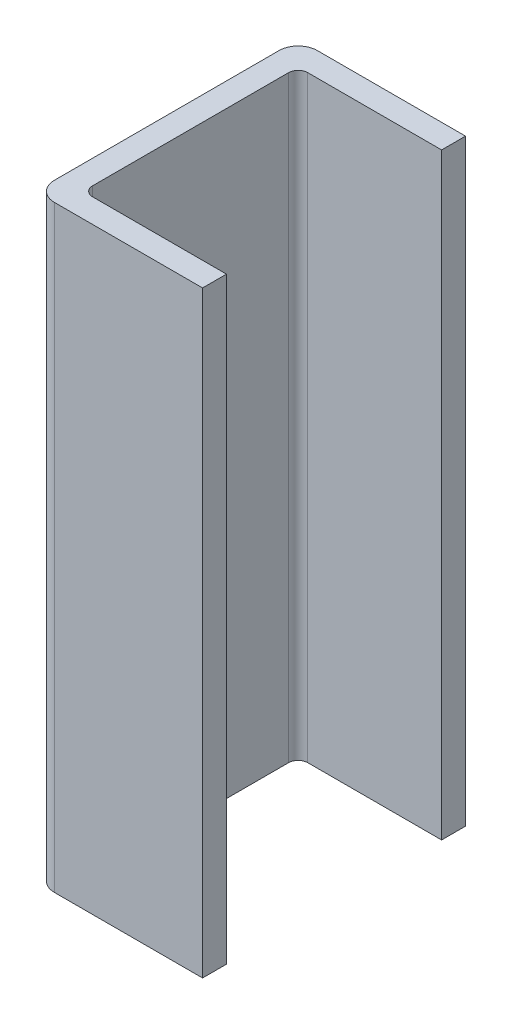
ISO-10303-21;
HEADER;
FILE_DESCRIPTION(('STEP AP214'),'2;1');
FILE_NAME('part.step','',(''),(''),'','','');
FILE_SCHEMA(('AUTOMOTIVE_DESIGN { 1 0 10303 214 1 1 1 1 }'));
ENDSEC;
DATA;
#1=APPLICATION_CONTEXT('core data for automotive mechanical design processes');
#2=APPLICATION_PROTOCOL_DEFINITION('international standard','automotive_design',2000,#1);
#3=PRODUCT_CONTEXT('',#1,'mechanical');
#4=PRODUCT('Part','Part','',(#3));
#5=PRODUCT_RELATED_PRODUCT_CATEGORY('part','',(#4));
#6=PRODUCT_DEFINITION_FORMATION('','',#4);
#7=PRODUCT_DEFINITION_CONTEXT('part definition',#1,'design');
#8=PRODUCT_DEFINITION('design','',#6,#7);
#9=PRODUCT_DEFINITION_SHAPE('','',#8);
#10=(LENGTH_UNIT() NAMED_UNIT(*) SI_UNIT(.MILLI.,.METRE.));
#11=(NAMED_UNIT(*) PLANE_ANGLE_UNIT() SI_UNIT($,.RADIAN.));
#12=(NAMED_UNIT(*) SI_UNIT($,.STERADIAN.) SOLID_ANGLE_UNIT());
#13=UNCERTAINTY_MEASURE_WITH_UNIT(LENGTH_MEASURE(1.E-05),#10,'distance_accuracy_value','');
#14=(GEOMETRIC_REPRESENTATION_CONTEXT(3) GLOBAL_UNCERTAINTY_ASSIGNED_CONTEXT((#13)) GLOBAL_UNIT_ASSIGNED_CONTEXT((#10,
#11,#12)) REPRESENTATION_CONTEXT('',''));
#15=CARTESIAN_POINT('',(0.,0.,0.));
#16=DIRECTION('',(0.,0.,1.));
#17=DIRECTION('',(1.,0.,0.));
#18=AXIS2_PLACEMENT_3D('',#15,#16,#17);
#19=CARTESIAN_POINT('',(-0.93,-0.625,0.07));
#20=DIRECTION('',(0.,-1.,0.));
#21=DIRECTION('',(-0.707106781186548,0.,-0.707106781186547));
#22=AXIS2_PLACEMENT_3D('',#19,#20,#21);
#23=CYLINDRICAL_SURFACE('',#22,0.02);
#24=CARTESIAN_POINT('',(-0.93,0.625,0.07));
#25=DIRECTION('',(0.,1.,0.));
#26=DIRECTION('',(0.,0.,-1.));
#27=AXIS2_PLACEMENT_3D('',#24,#25,#26);
#28=CIRCLE('',#27,0.02);
#29=CARTESIAN_POINT('',(-0.93,0.625,0.05));
#30=VERTEX_POINT('',#29);
#31=CARTESIAN_POINT('',(-0.95,0.625,0.07));
#32=VERTEX_POINT('',#31);
#33=EDGE_CURVE('E11',#30,#32,#28,.T.);
#34=ORIENTED_EDGE('',*,*,#33,.T.);
#35=DIRECTION('',(0.,-1.,0.));
#36=VECTOR('',#35,1.);
#37=CARTESIAN_POINT('',(-0.95,0.625,0.07));
#38=LINE('',#37,#36);
#39=CARTESIAN_POINT('',(-0.95,-0.625,0.07));
#40=VERTEX_POINT('',#39);
#41=EDGE_CURVE('E24',#32,#40,#38,.T.);
#42=ORIENTED_EDGE('',*,*,#41,.T.);
#43=CARTESIAN_POINT('',(-0.93,-0.625,0.07));
#44=DIRECTION('',(0.,-1.,0.));
#45=DIRECTION('',(-1.,0.,0.));
#46=AXIS2_PLACEMENT_3D('',#43,#44,#45);
#47=CIRCLE('',#46,0.02);
#48=CARTESIAN_POINT('',(-0.93,-0.625,0.05));
#49=VERTEX_POINT('',#48);
#50=EDGE_CURVE('E193',#40,#49,#47,.T.);
#51=ORIENTED_EDGE('',*,*,#50,.T.);
#52=DIRECTION('',(0.,1.,0.));
#53=VECTOR('',#52,1.);
#54=CARTESIAN_POINT('',(-0.93,-0.625,0.05));
#55=LINE('',#54,#53);
#56=EDGE_CURVE('E186',#49,#30,#55,.T.);
#57=ORIENTED_EDGE('',*,*,#56,.T.);
#58=EDGE_LOOP('',(#34,#42,#51,#57));
#59=FACE_BOUND('',#58,.T.);
#60=ADVANCED_FACE('F17',(#59),#23,.F.);
#61=CARTESIAN_POINT('',(-0.95,-0.625,0.55));
#62=DIRECTION('',(1.,0.,0.));
#63=DIRECTION('',(0.,0.,-1.));
#64=AXIS2_PLACEMENT_3D('',#61,#62,#63);
#65=PLANE('',#64);
#66=ORIENTED_EDGE('',*,*,#41,.F.);
#67=DIRECTION('',(0.,0.,1.));
#68=VECTOR('',#67,1.);
#69=CARTESIAN_POINT('',(-0.95,0.625,0.07));
#70=LINE('',#69,#68);
#71=CARTESIAN_POINT('',(-0.95,0.625,0.48));
#72=VERTEX_POINT('',#71);
#73=EDGE_CURVE('E195',#32,#72,#70,.T.);
#74=ORIENTED_EDGE('',*,*,#73,.T.);
#75=DIRECTION('',(0.,1.,0.));
#76=VECTOR('',#75,1.);
#77=CARTESIAN_POINT('',(-0.95,-0.625,0.48));
#78=LINE('',#77,#76);
#79=CARTESIAN_POINT('',(-0.95,-0.625,0.48));
#80=VERTEX_POINT('',#79);
#81=EDGE_CURVE('E188',#80,#72,#78,.T.);
#82=ORIENTED_EDGE('',*,*,#81,.F.);
#83=DIRECTION('',(0.,0.,-1.));
#84=VECTOR('',#83,1.);
#85=CARTESIAN_POINT('',(-0.95,-0.625,0.48));
#86=LINE('',#85,#84);
#87=EDGE_CURVE('E180',#80,#40,#86,.T.);
#88=ORIENTED_EDGE('',*,*,#87,.T.);
#89=EDGE_LOOP('',(#66,#74,#82,#88));
#90=FACE_BOUND('',#89,.T.);
#91=ADVANCED_FACE('F202',(#90),#65,.T.);
#92=CARTESIAN_POINT('',(-0.93,-0.625,0.48));
#93=DIRECTION('',(0.,1.,0.));
#94=DIRECTION('',(-0.707106781186548,0.,0.707106781186548));
#95=AXIS2_PLACEMENT_3D('',#92,#93,#94);
#96=CYLINDRICAL_SURFACE('',#95,0.02);
#97=CARTESIAN_POINT('',(-0.93,-0.625,0.48));
#98=DIRECTION('',(0.,-1.,0.));
#99=DIRECTION('',(0.,0.,1.));
#100=AXIS2_PLACEMENT_3D('',#97,#98,#99);
#101=CIRCLE('',#100,0.02);
#102=CARTESIAN_POINT('',(-0.93,-0.625,0.5));
#103=VERTEX_POINT('',#102);
#104=EDGE_CURVE('E107',#103,#80,#101,.T.);
#105=ORIENTED_EDGE('',*,*,#104,.T.);
#106=ORIENTED_EDGE('',*,*,#81,.T.);
#107=CARTESIAN_POINT('',(-0.93,0.625,0.48));
#108=DIRECTION('',(0.,1.,0.));
#109=DIRECTION('',(-1.,0.,0.));
#110=AXIS2_PLACEMENT_3D('',#107,#108,#109);
#111=CIRCLE('',#110,0.02);
#112=CARTESIAN_POINT('',(-0.93,0.625,0.5));
#113=VERTEX_POINT('',#112);
#114=EDGE_CURVE('E182',#72,#113,#111,.T.);
#115=ORIENTED_EDGE('',*,*,#114,.T.);
#116=DIRECTION('',(0.,-1.,0.));
#117=VECTOR('',#116,1.);
#118=CARTESIAN_POINT('',(-0.93,0.625,0.5));
#119=LINE('',#118,#117);
#120=EDGE_CURVE('E174',#113,#103,#119,.T.);
#121=ORIENTED_EDGE('',*,*,#120,.T.);
#122=EDGE_LOOP('',(#105,#106,#115,#121));
#123=FACE_BOUND('',#122,.T.);
#124=ADVANCED_FACE('F199',(#123),#96,.F.);
#125=CARTESIAN_POINT('',(-0.96,0.3125,0.04));
#126=DIRECTION('',(0.,-1.,0.));
#127=DIRECTION('',(-0.707106781186548,0.,-0.707106781186547));
#128=AXIS2_PLACEMENT_3D('',#125,#126,#127);
#129=CYLINDRICAL_SURFACE('',#128,0.04);
#130=CARTESIAN_POINT('',(-0.96,-0.625,0.04));
#131=DIRECTION('',(0.,1.,0.));
#132=DIRECTION('',(0.,0.,-1.));
#133=AXIS2_PLACEMENT_3D('',#130,#131,#132);
#134=CIRCLE('',#133,0.04);
#135=CARTESIAN_POINT('',(-0.96,-0.625,0.));
#136=VERTEX_POINT('',#135);
#137=CARTESIAN_POINT('',(-1.,-0.625,0.04));
#138=VERTEX_POINT('',#137);
#139=EDGE_CURVE('E191',#136,#138,#134,.T.);
#140=ORIENTED_EDGE('',*,*,#139,.T.);
#141=DIRECTION('',(0.,1.,0.));
#142=VECTOR('',#141,1.);
#143=CARTESIAN_POINT('',(-1.,-0.625,0.04));
#144=LINE('',#143,#142);
#145=CARTESIAN_POINT('',(-1.,0.625,0.04));
#146=VERTEX_POINT('',#145);
#147=EDGE_CURVE('E184',#138,#146,#144,.T.);
#148=ORIENTED_EDGE('',*,*,#147,.T.);
#149=CARTESIAN_POINT('',(-0.96,0.625,0.04));
#150=DIRECTION('',(0.,-1.,0.));
#151=DIRECTION('',(-1.,0.,0.));
#152=AXIS2_PLACEMENT_3D('',#149,#150,#151);
#153=CIRCLE('',#152,0.04);
#154=CARTESIAN_POINT('',(-0.96,0.625,0.));
#155=VERTEX_POINT('',#154);
#156=EDGE_CURVE('E176',#146,#155,#153,.T.);
#157=ORIENTED_EDGE('',*,*,#156,.T.);
#158=DIRECTION('',(0.,-1.,0.));
#159=VECTOR('',#158,1.);
#160=CARTESIAN_POINT('',(-0.96,0.625,0.));
#161=LINE('',#160,#159);
#162=EDGE_CURVE('E164',#155,#136,#161,.T.);
#163=ORIENTED_EDGE('',*,*,#162,.T.);
#164=EDGE_LOOP('',(#140,#148,#157,#163));
#165=FACE_BOUND('',#164,.T.);
#166=ADVANCED_FACE('F228',(#165),#129,.T.);
#167=CARTESIAN_POINT('',(-1.,0.625,0.));
#168=DIRECTION('',(-1.,0.,0.));
#169=DIRECTION('',(0.,-1.,0.));
#170=AXIS2_PLACEMENT_3D('',#167,#168,#169);
#171=PLANE('',#170);
#172=ORIENTED_EDGE('',*,*,#147,.F.);
#173=DIRECTION('',(0.,0.,1.));
#174=VECTOR('',#173,1.);
#175=CARTESIAN_POINT('',(-1.,-0.625,0.04));
#176=LINE('',#175,#174);
#177=CARTESIAN_POINT('',(-1.,-0.625,0.51));
#178=VERTEX_POINT('',#177);
#179=EDGE_CURVE('E178',#138,#178,#176,.T.);
#180=ORIENTED_EDGE('',*,*,#179,.T.);
#181=DIRECTION('',(0.,-1.,0.));
#182=VECTOR('',#181,1.);
#183=CARTESIAN_POINT('',(-1.,0.625,0.51));
#184=LINE('',#183,#182);
#185=CARTESIAN_POINT('',(-1.,0.625,0.51));
#186=VERTEX_POINT('',#185);
#187=EDGE_CURVE('E167',#186,#178,#184,.T.);
#188=ORIENTED_EDGE('',*,*,#187,.F.);
#189=DIRECTION('',(0.,0.,1.));
#190=VECTOR('',#189,1.);
#191=CARTESIAN_POINT('',(-1.,0.625,0.04));
#192=LINE('',#191,#190);
#193=EDGE_CURVE('E156',#146,#186,#192,.T.);
#194=ORIENTED_EDGE('',*,*,#193,.F.);
#195=EDGE_LOOP('',(#172,#180,#188,#194));
#196=FACE_BOUND('',#195,.T.);
#197=ADVANCED_FACE('F226',(#196),#171,.T.);
#198=CARTESIAN_POINT('',(-1.,-0.625,0.));
#199=DIRECTION('',(0.,-1.,0.));
#200=DIRECTION('',(1.,0.,0.));
#201=AXIS2_PLACEMENT_3D('',#198,#199,#200);
#202=PLANE('',#201);
#203=ORIENTED_EDGE('',*,*,#139,.F.);
#204=DIRECTION('',(1.,0.,0.));
#205=VECTOR('',#204,1.);
#206=CARTESIAN_POINT('',(-0.96,-0.625,0.));
#207=LINE('',#206,#205);
#208=CARTESIAN_POINT('',(-0.65,-0.625,0.));
#209=VERTEX_POINT('',#208);
#210=EDGE_CURVE('E170',#136,#209,#207,.T.);
#211=ORIENTED_EDGE('',*,*,#210,.T.);
#212=DIRECTION('',(0.,0.,-1.));
#213=VECTOR('',#212,1.);
#214=CARTESIAN_POINT('',(-0.65,-0.625,0.05));
#215=LINE('',#214,#213);
#216=CARTESIAN_POINT('',(-0.65,-0.625,0.05));
#217=VERTEX_POINT('',#216);
#218=EDGE_CURVE('E159',#217,#209,#215,.T.);
#219=ORIENTED_EDGE('',*,*,#218,.F.);
#220=DIRECTION('',(1.,0.,0.));
#221=VECTOR('',#220,1.);
#222=CARTESIAN_POINT('',(-0.93,-0.625,0.05));
#223=LINE('',#222,#221);
#224=EDGE_CURVE('E147',#49,#217,#223,.T.);
#225=ORIENTED_EDGE('',*,*,#224,.F.);
#226=ORIENTED_EDGE('',*,*,#50,.F.);
#227=ORIENTED_EDGE('',*,*,#87,.F.);
#228=ORIENTED_EDGE('',*,*,#104,.F.);
#229=DIRECTION('',(-1.,0.,0.));
#230=VECTOR('',#229,1.);
#231=CARTESIAN_POINT('',(-0.65,-0.625,0.5));
#232=LINE('',#231,#230);
#233=CARTESIAN_POINT('',(-0.65,-0.625,0.5));
#234=VERTEX_POINT('',#233);
#235=EDGE_CURVE('E101',#234,#103,#232,.T.);
#236=ORIENTED_EDGE('',*,*,#235,.F.);
#237=DIRECTION('',(0.,0.,-1.));
#238=VECTOR('',#237,1.);
#239=CARTESIAN_POINT('',(-0.65,-0.625,0.55));
#240=LINE('',#239,#238);
#241=CARTESIAN_POINT('',(-0.65,-0.625,0.55));
#242=VERTEX_POINT('',#241);
#243=EDGE_CURVE('E105',#242,#234,#240,.T.);
#244=ORIENTED_EDGE('',*,*,#243,.F.);
#245=DIRECTION('',(1.,0.,0.));
#246=VECTOR('',#245,1.);
#247=CARTESIAN_POINT('',(-0.96,-0.625,0.55));
#248=LINE('',#247,#246);
#249=CARTESIAN_POINT('',(-0.96,-0.625,0.55));
#250=VERTEX_POINT('',#249);
#251=EDGE_CURVE('E111',#250,#242,#248,.T.);
#252=ORIENTED_EDGE('',*,*,#251,.F.);
#253=CARTESIAN_POINT('',(-0.96,-0.625,0.51));
#254=DIRECTION('',(0.,1.,0.));
#255=DIRECTION('',(-1.,0.,0.));
#256=AXIS2_PLACEMENT_3D('',#253,#254,#255);
#257=CIRCLE('',#256,0.04);
#258=EDGE_CURVE('E172',#178,#250,#257,.T.);
#259=ORIENTED_EDGE('',*,*,#258,.F.);
#260=ORIENTED_EDGE('',*,*,#179,.F.);
#261=EDGE_LOOP('',(#203,#211,#219,#225,#226,#227,#228,#236,#244,#252,#259,#260));
#262=FACE_BOUND('',#261,.T.);
#263=ADVANCED_FACE('F103',(#262),#202,.T.);
#264=CARTESIAN_POINT('',(-0.96,0.,0.51));
#265=DIRECTION('',(0.,-1.,0.));
#266=DIRECTION('',(-0.707106781186548,0.,0.707106781186548));
#267=AXIS2_PLACEMENT_3D('',#264,#265,#266);
#268=CYLINDRICAL_SURFACE('',#267,0.04);
#269=ORIENTED_EDGE('',*,*,#258,.T.);
#270=DIRECTION('',(0.,1.,0.));
#271=VECTOR('',#270,1.);
#272=CARTESIAN_POINT('',(-0.96,-0.625,0.55));
#273=LINE('',#272,#271);
#274=CARTESIAN_POINT('',(-0.96,0.625,0.55));
#275=VERTEX_POINT('',#274);
#276=EDGE_CURVE('E162',#250,#275,#273,.T.);
#277=ORIENTED_EDGE('',*,*,#276,.T.);
#278=CARTESIAN_POINT('',(-0.96,0.625,0.51));
#279=DIRECTION('',(0.,-1.,0.));
#280=DIRECTION('',(0.,0.,1.));
#281=AXIS2_PLACEMENT_3D('',#278,#279,#280);
#282=CIRCLE('',#281,0.04);
#283=EDGE_CURVE('E150',#275,#186,#282,.T.);
#284=ORIENTED_EDGE('',*,*,#283,.T.);
#285=ORIENTED_EDGE('',*,*,#187,.T.);
#286=EDGE_LOOP('',(#269,#277,#284,#285));
#287=FACE_BOUND('',#286,.T.);
#288=ADVANCED_FACE('F222',(#287),#268,.T.);
#289=CARTESIAN_POINT('',(0.,0.,0.));
#290=DIRECTION('',(0.,0.,1.));
#291=DIRECTION('',(1.,0.,0.));
#292=AXIS2_PLACEMENT_3D('',#289,#290,#291);
#293=PLANE('',#292);
#294=ORIENTED_EDGE('',*,*,#162,.F.);
#295=DIRECTION('',(-1.,0.,0.));
#296=VECTOR('',#295,1.);
#297=CARTESIAN_POINT('',(-0.65,0.625,0.));
#298=LINE('',#297,#296);
#299=CARTESIAN_POINT('',(-0.65,0.625,0.));
#300=VERTEX_POINT('',#299);
#301=EDGE_CURVE('E153',#300,#155,#298,.T.);
#302=ORIENTED_EDGE('',*,*,#301,.F.);
#303=DIRECTION('',(0.,1.,0.));
#304=VECTOR('',#303,1.);
#305=CARTESIAN_POINT('',(-0.65,-0.625,0.));
#306=LINE('',#305,#304);
#307=EDGE_CURVE('E142',#209,#300,#306,.T.);
#308=ORIENTED_EDGE('',*,*,#307,.F.);
#309=ORIENTED_EDGE('',*,*,#210,.F.);
#310=EDGE_LOOP('',(#294,#302,#308,#309));
#311=FACE_BOUND('',#310,.T.);
#312=ADVANCED_FACE('F233',(#311),#293,.F.);
#313=CARTESIAN_POINT('',(1.,0.625,0.));
#314=DIRECTION('',(0.,1.,0.));
#315=DIRECTION('',(-1.,0.,0.));
#316=AXIS2_PLACEMENT_3D('',#313,#314,#315);
#317=PLANE('',#316);
#318=ORIENTED_EDGE('',*,*,#156,.F.);
#319=ORIENTED_EDGE('',*,*,#193,.T.);
#320=ORIENTED_EDGE('',*,*,#283,.F.);
#321=DIRECTION('',(-1.,0.,0.));
#322=VECTOR('',#321,1.);
#323=CARTESIAN_POINT('',(-0.65,0.625,0.55));
#324=LINE('',#323,#322);
#325=CARTESIAN_POINT('',(-0.65,0.625,0.55));
#326=VERTEX_POINT('',#325);
#327=EDGE_CURVE('E136',#326,#275,#324,.T.);
#328=ORIENTED_EDGE('',*,*,#327,.F.);
#329=DIRECTION('',(0.,0.,1.));
#330=VECTOR('',#329,1.);
#331=CARTESIAN_POINT('',(-0.65,0.625,0.5));
#332=LINE('',#331,#330);
#333=CARTESIAN_POINT('',(-0.65,0.625,0.5));
#334=VERTEX_POINT('',#333);
#335=EDGE_CURVE('E134',#334,#326,#332,.T.);
#336=ORIENTED_EDGE('',*,*,#335,.F.);
#337=DIRECTION('',(1.,0.,0.));
#338=VECTOR('',#337,1.);
#339=CARTESIAN_POINT('',(-0.93,0.625,0.5));
#340=LINE('',#339,#338);
#341=EDGE_CURVE('E121',#113,#334,#340,.T.);
#342=ORIENTED_EDGE('',*,*,#341,.F.);
#343=ORIENTED_EDGE('',*,*,#114,.F.);
#344=ORIENTED_EDGE('',*,*,#73,.F.);
#345=ORIENTED_EDGE('',*,*,#33,.F.);
#346=DIRECTION('',(-1.,0.,0.));
#347=VECTOR('',#346,1.);
#348=CARTESIAN_POINT('',(-0.65,0.625,0.05));
#349=LINE('',#348,#347);
#350=CARTESIAN_POINT('',(-0.65,0.625,0.05));
#351=VERTEX_POINT('',#350);
#352=EDGE_CURVE('E129',#351,#30,#349,.T.);
#353=ORIENTED_EDGE('',*,*,#352,.F.);
#354=DIRECTION('',(0.,0.,1.));
#355=VECTOR('',#354,1.);
#356=CARTESIAN_POINT('',(-0.65,0.625,0.));
#357=LINE('',#356,#355);
#358=EDGE_CURVE('E145',#300,#351,#357,.T.);
#359=ORIENTED_EDGE('',*,*,#358,.F.);
#360=ORIENTED_EDGE('',*,*,#301,.T.);
#361=EDGE_LOOP('',(#318,#319,#320,#328,#336,#342,#343,#344,#345,#353,#359,#360));
#362=FACE_BOUND('',#361,.T.);
#363=ADVANCED_FACE('F214',(#362),#317,.T.);
#364=CARTESIAN_POINT('',(-0.65,-0.625,0.05));
#365=DIRECTION('',(1.,0.,0.));
#366=DIRECTION('',(0.,0.,-1.));
#367=AXIS2_PLACEMENT_3D('',#364,#365,#366);
#368=PLANE('',#367);
#369=ORIENTED_EDGE('',*,*,#358,.T.);
#370=DIRECTION('',(0.,1.,0.));
#371=VECTOR('',#370,1.);
#372=CARTESIAN_POINT('',(-0.65,-0.625,0.05));
#373=LINE('',#372,#371);
#374=EDGE_CURVE('E139',#217,#351,#373,.T.);
#375=ORIENTED_EDGE('',*,*,#374,.F.);
#376=ORIENTED_EDGE('',*,*,#218,.T.);
#377=ORIENTED_EDGE('',*,*,#307,.T.);
#378=EDGE_LOOP('',(#369,#375,#376,#377));
#379=FACE_BOUND('',#378,.T.);
#380=ADVANCED_FACE('F235',(#379),#368,.T.);
#381=CARTESIAN_POINT('',(-1.,-0.625,0.05));
#382=DIRECTION('',(0.,0.,1.));
#383=DIRECTION('',(1.,0.,0.));
#384=AXIS2_PLACEMENT_3D('',#381,#382,#383);
#385=PLANE('',#384);
#386=ORIENTED_EDGE('',*,*,#56,.F.);
#387=ORIENTED_EDGE('',*,*,#224,.T.);
#388=ORIENTED_EDGE('',*,*,#374,.T.);
#389=ORIENTED_EDGE('',*,*,#352,.T.);
#390=EDGE_LOOP('',(#386,#387,#388,#389));
#391=FACE_BOUND('',#390,.T.);
#392=ADVANCED_FACE('F209',(#391),#385,.T.);
#393=CARTESIAN_POINT('',(-1.,-0.625,0.55));
#394=DIRECTION('',(0.,0.,1.));
#395=DIRECTION('',(1.,0.,0.));
#396=AXIS2_PLACEMENT_3D('',#393,#394,#395);
#397=PLANE('',#396);
#398=ORIENTED_EDGE('',*,*,#276,.F.);
#399=ORIENTED_EDGE('',*,*,#251,.T.);
#400=DIRECTION('',(0.,1.,0.));
#401=VECTOR('',#400,1.);
#402=CARTESIAN_POINT('',(-0.65,-0.625,0.55));
#403=LINE('',#402,#401);
#404=EDGE_CURVE('E112',#242,#326,#403,.T.);
#405=ORIENTED_EDGE('',*,*,#404,.T.);
#406=ORIENTED_EDGE('',*,*,#327,.T.);
#407=EDGE_LOOP('',(#398,#399,#405,#406));
#408=FACE_BOUND('',#407,.T.);
#409=ADVANCED_FACE('F218',(#408),#397,.T.);
#410=CARTESIAN_POINT('',(-0.65,-0.625,0.55));
#411=DIRECTION('',(1.,0.,0.));
#412=DIRECTION('',(0.,0.,-1.));
#413=AXIS2_PLACEMENT_3D('',#410,#411,#412);
#414=PLANE('',#413);
#415=ORIENTED_EDGE('',*,*,#335,.T.);
#416=ORIENTED_EDGE('',*,*,#404,.F.);
#417=ORIENTED_EDGE('',*,*,#243,.T.);
#418=DIRECTION('',(0.,1.,0.));
#419=VECTOR('',#418,1.);
#420=CARTESIAN_POINT('',(-0.65,-0.625,0.5));
#421=LINE('',#420,#419);
#422=EDGE_CURVE('E119',#234,#334,#421,.T.);
#423=ORIENTED_EDGE('',*,*,#422,.T.);
#424=EDGE_LOOP('',(#415,#416,#417,#423));
#425=FACE_BOUND('',#424,.T.);
#426=ADVANCED_FACE('F118',(#425),#414,.T.);
#427=CARTESIAN_POINT('',(-0.65,-0.625,0.5));
#428=DIRECTION('',(0.,0.,-1.));
#429=DIRECTION('',(-1.,0.,0.));
#430=AXIS2_PLACEMENT_3D('',#427,#428,#429);
#431=PLANE('',#430);
#432=ORIENTED_EDGE('',*,*,#120,.F.);
#433=ORIENTED_EDGE('',*,*,#341,.T.);
#434=ORIENTED_EDGE('',*,*,#422,.F.);
#435=ORIENTED_EDGE('',*,*,#235,.T.);
#436=EDGE_LOOP('',(#432,#433,#434,#435));
#437=FACE_BOUND('',#436,.T.);
#438=ADVANCED_FACE('F124',(#437),#431,.T.);
#439=CLOSED_SHELL('',(#60,#91,#124,#166,#197,#263,#288,#312,#363,#380,#392,#409,#426,#438));
#440=MANIFOLD_SOLID_BREP('B1',#439);
#441=ADVANCED_BREP_SHAPE_REPRESENTATION('',(#18,#440),#14);
#442=SHAPE_DEFINITION_REPRESENTATION(#9,#441);
ENDSEC;
END-ISO-10303-21;
